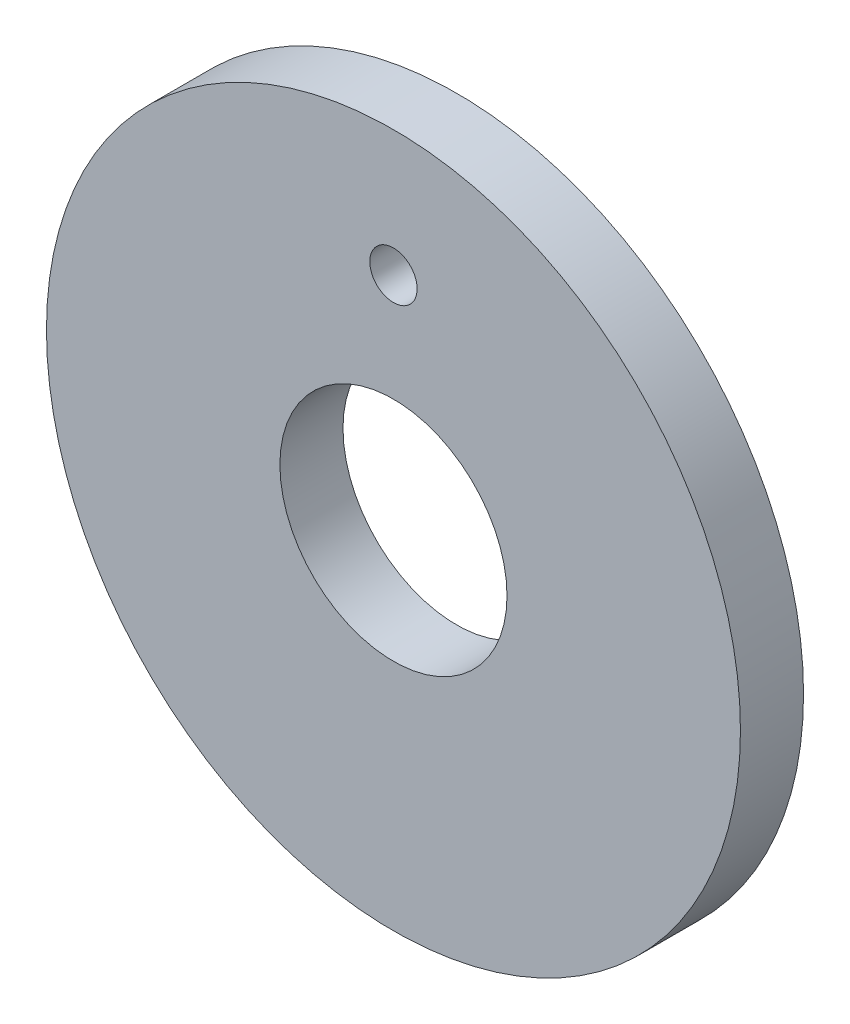
ISO-10303-21;
HEADER;
FILE_DESCRIPTION(('STEP AP214'),'2;1');
FILE_NAME('part.step','',(''),(''),'','','');
FILE_SCHEMA(('AUTOMOTIVE_DESIGN { 1 0 10303 214 1 1 1 1 }'));
ENDSEC;
DATA;
#1=APPLICATION_CONTEXT('core data for automotive mechanical design processes');
#2=APPLICATION_PROTOCOL_DEFINITION('international standard','automotive_design',2000,#1);
#3=PRODUCT_CONTEXT('',#1,'mechanical');
#4=PRODUCT('Part','Part','',(#3));
#5=PRODUCT_RELATED_PRODUCT_CATEGORY('part','',(#4));
#6=PRODUCT_DEFINITION_FORMATION('','',#4);
#7=PRODUCT_DEFINITION_CONTEXT('part definition',#1,'design');
#8=PRODUCT_DEFINITION('design','',#6,#7);
#9=PRODUCT_DEFINITION_SHAPE('','',#8);
#10=(LENGTH_UNIT() NAMED_UNIT(*) SI_UNIT(.MILLI.,.METRE.));
#11=(NAMED_UNIT(*) PLANE_ANGLE_UNIT() SI_UNIT($,.RADIAN.));
#12=(NAMED_UNIT(*) SI_UNIT($,.STERADIAN.) SOLID_ANGLE_UNIT());
#13=UNCERTAINTY_MEASURE_WITH_UNIT(LENGTH_MEASURE(1.E-05),#10,'distance_accuracy_value','');
#14=(GEOMETRIC_REPRESENTATION_CONTEXT(3) GLOBAL_UNCERTAINTY_ASSIGNED_CONTEXT((#13)) GLOBAL_UNIT_ASSIGNED_CONTEXT((#10,
#11,#12)) REPRESENTATION_CONTEXT('',''));
#15=CARTESIAN_POINT('',(0.,0.,0.));
#16=DIRECTION('',(0.,0.,1.));
#17=DIRECTION('',(1.,0.,0.));
#18=AXIS2_PLACEMENT_3D('',#15,#16,#17);
#19=CARTESIAN_POINT('',(0.,0.,2.));
#20=DIRECTION('',(0.,0.,1.));
#21=DIRECTION('',(1.,0.,0.));
#22=AXIS2_PLACEMENT_3D('',#19,#20,#21);
#23=PLANE('',#22);
#24=CARTESIAN_POINT('',(0.,7.,2.));
#25=DIRECTION('',(0.,0.,1.));
#26=DIRECTION('',(1.,0.,0.));
#27=AXIS2_PLACEMENT_3D('',#24,#25,#26);
#28=CIRCLE('',#27,0.75);
#29=CARTESIAN_POINT('',(0.75,7.,2.));
#30=VERTEX_POINT('',#29);
#31=EDGE_CURVE('E42',#30,#30,#28,.T.);
#32=ORIENTED_EDGE('',*,*,#31,.F.);
#33=EDGE_LOOP('',(#32));
#34=FACE_BOUND('',#33,.T.);
#35=CARTESIAN_POINT('',(0.,0.,2.));
#36=DIRECTION('',(0.,0.,1.));
#37=DIRECTION('',(1.,0.,0.));
#38=AXIS2_PLACEMENT_3D('',#35,#36,#37);
#39=CIRCLE('',#38,11.);
#40=CARTESIAN_POINT('',(11.,0.,2.));
#41=VERTEX_POINT('',#40);
#42=EDGE_CURVE('E10',#41,#41,#39,.T.);
#43=ORIENTED_EDGE('',*,*,#42,.T.);
#44=EDGE_LOOP('',(#43));
#45=FACE_BOUND('',#44,.T.);
#46=CARTESIAN_POINT('',(0.,0.,2.));
#47=DIRECTION('',(0.,0.,1.));
#48=DIRECTION('',(1.,0.,0.));
#49=AXIS2_PLACEMENT_3D('',#46,#47,#48);
#50=CIRCLE('',#49,3.6);
#51=CARTESIAN_POINT('',(3.6,0.,2.));
#52=VERTEX_POINT('',#51);
#53=EDGE_CURVE('E47',#52,#52,#50,.T.);
#54=ORIENTED_EDGE('',*,*,#53,.F.);
#55=EDGE_LOOP('',(#54));
#56=FACE_BOUND('',#55,.T.);
#57=ADVANCED_FACE('F31',(#34,#45,#56),#23,.T.);
#58=CARTESIAN_POINT('',(0.,0.,0.));
#59=DIRECTION('',(0.,0.,1.));
#60=DIRECTION('',(1.,0.,0.));
#61=AXIS2_PLACEMENT_3D('',#58,#59,#60);
#62=PLANE('',#61);
#63=CARTESIAN_POINT('',(0.,7.,0.));
#64=DIRECTION('',(0.,0.,1.));
#65=DIRECTION('',(1.,0.,0.));
#66=AXIS2_PLACEMENT_3D('',#63,#64,#65);
#67=CIRCLE('',#66,0.75);
#68=CARTESIAN_POINT('',(0.75,7.,0.));
#69=VERTEX_POINT('',#68);
#70=EDGE_CURVE('E44',#69,#69,#67,.T.);
#71=ORIENTED_EDGE('',*,*,#70,.T.);
#72=EDGE_LOOP('',(#71));
#73=FACE_BOUND('',#72,.T.);
#74=CARTESIAN_POINT('',(0.,0.,0.));
#75=DIRECTION('',(0.,0.,1.));
#76=DIRECTION('',(1.,0.,0.));
#77=AXIS2_PLACEMENT_3D('',#74,#75,#76);
#78=CIRCLE('',#77,11.);
#79=CARTESIAN_POINT('',(11.,0.,0.));
#80=VERTEX_POINT('',#79);
#81=EDGE_CURVE('E35',#80,#80,#78,.T.);
#82=ORIENTED_EDGE('',*,*,#81,.F.);
#83=EDGE_LOOP('',(#82));
#84=FACE_BOUND('',#83,.T.);
#85=CARTESIAN_POINT('',(0.,0.,0.));
#86=DIRECTION('',(0.,0.,1.));
#87=DIRECTION('',(1.,0.,0.));
#88=AXIS2_PLACEMENT_3D('',#85,#86,#87);
#89=CIRCLE('',#88,3.6);
#90=CARTESIAN_POINT('',(3.6,0.,0.));
#91=VERTEX_POINT('',#90);
#92=EDGE_CURVE('E50',#91,#91,#89,.T.);
#93=ORIENTED_EDGE('',*,*,#92,.T.);
#94=EDGE_LOOP('',(#93));
#95=FACE_BOUND('',#94,.T.);
#96=ADVANCED_FACE('F60',(#73,#84,#95),#62,.F.);
#97=CARTESIAN_POINT('',(0.,0.,2.));
#98=DIRECTION('',(0.,0.,-1.));
#99=DIRECTION('',(-1.,0.,0.));
#100=AXIS2_PLACEMENT_3D('',#97,#98,#99);
#101=CYLINDRICAL_SURFACE('',#100,11.);
#102=ORIENTED_EDGE('',*,*,#42,.F.);
#103=EDGE_LOOP('',(#102));
#104=FACE_BOUND('',#103,.T.);
#105=ORIENTED_EDGE('',*,*,#81,.T.);
#106=EDGE_LOOP('',(#105));
#107=FACE_BOUND('',#106,.T.);
#108=ADVANCED_FACE('F33',(#104,#107),#101,.T.);
#109=CARTESIAN_POINT('',(0.,7.,2.));
#110=DIRECTION('',(0.,0.,-1.));
#111=DIRECTION('',(-1.,0.,0.));
#112=AXIS2_PLACEMENT_3D('',#109,#110,#111);
#113=CYLINDRICAL_SURFACE('',#112,0.75);
#114=ORIENTED_EDGE('',*,*,#31,.T.);
#115=EDGE_LOOP('',(#114));
#116=FACE_BOUND('',#115,.T.);
#117=ORIENTED_EDGE('',*,*,#70,.F.);
#118=EDGE_LOOP('',(#117));
#119=FACE_BOUND('',#118,.T.);
#120=ADVANCED_FACE('F69',(#116,#119),#113,.F.);
#121=CARTESIAN_POINT('',(0.,0.,2.));
#122=DIRECTION('',(0.,0.,-1.));
#123=DIRECTION('',(-1.,0.,0.));
#124=AXIS2_PLACEMENT_3D('',#121,#122,#123);
#125=CYLINDRICAL_SURFACE('',#124,3.6);
#126=ORIENTED_EDGE('',*,*,#53,.T.);
#127=EDGE_LOOP('',(#126));
#128=FACE_BOUND('',#127,.T.);
#129=ORIENTED_EDGE('',*,*,#92,.F.);
#130=EDGE_LOOP('',(#129));
#131=FACE_BOUND('',#130,.T.);
#132=ADVANCED_FACE('F56',(#128,#131),#125,.F.);
#133=CLOSED_SHELL('',(#57,#96,#108,#120,#132));
#134=MANIFOLD_SOLID_BREP('B2',#133);
#135=ADVANCED_BREP_SHAPE_REPRESENTATION('',(#18,#134),#14);
#136=SHAPE_DEFINITION_REPRESENTATION(#9,#135);
ENDSEC;
END-ISO-10303-21;
